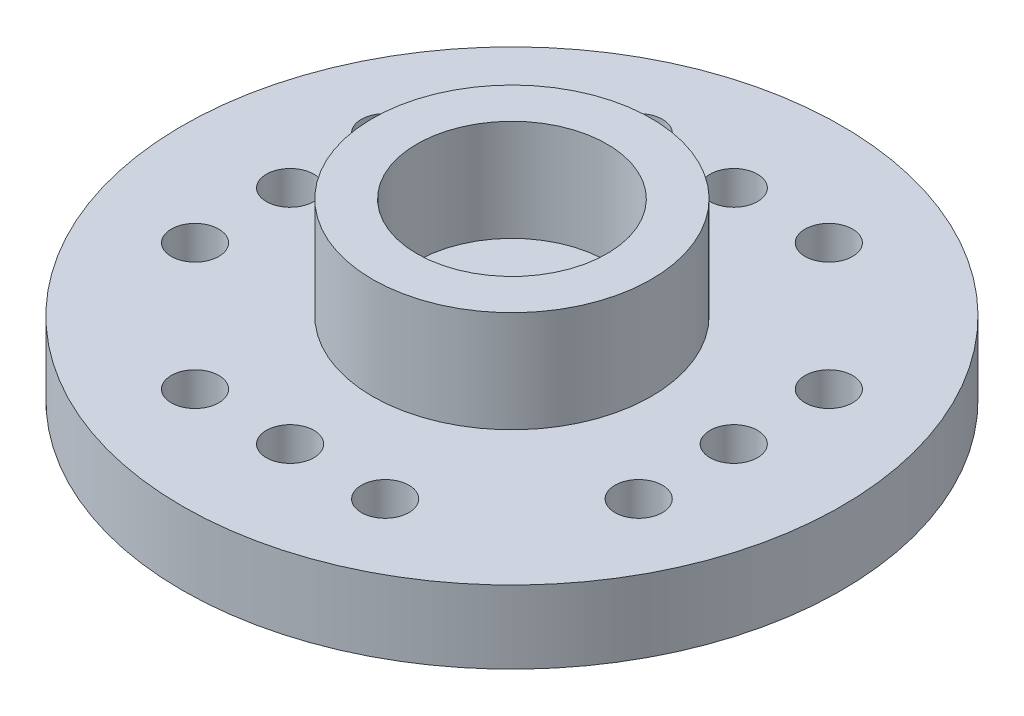
ISO-10303-21;
HEADER;
FILE_DESCRIPTION(('STEP AP214'),'2;1');
FILE_NAME('part.step','',(''),(''),'','','');
FILE_SCHEMA(('AUTOMOTIVE_DESIGN { 1 0 10303 214 1 1 1 1 }'));
ENDSEC;
DATA;
#1=APPLICATION_CONTEXT('core data for automotive mechanical design processes');
#2=APPLICATION_PROTOCOL_DEFINITION('international standard','automotive_design',2000,#1);
#3=PRODUCT_CONTEXT('',#1,'mechanical');
#4=PRODUCT('Part','Part','',(#3));
#5=PRODUCT_RELATED_PRODUCT_CATEGORY('part','',(#4));
#6=PRODUCT_DEFINITION_FORMATION('','',#4);
#7=PRODUCT_DEFINITION_CONTEXT('part definition',#1,'design');
#8=PRODUCT_DEFINITION('design','',#6,#7);
#9=PRODUCT_DEFINITION_SHAPE('','',#8);
#10=(LENGTH_UNIT() NAMED_UNIT(*) SI_UNIT(.MILLI.,.METRE.));
#11=(NAMED_UNIT(*) PLANE_ANGLE_UNIT() SI_UNIT($,.RADIAN.));
#12=(NAMED_UNIT(*) SI_UNIT($,.STERADIAN.) SOLID_ANGLE_UNIT());
#13=UNCERTAINTY_MEASURE_WITH_UNIT(LENGTH_MEASURE(1.E-05),#10,'distance_accuracy_value','');
#14=(GEOMETRIC_REPRESENTATION_CONTEXT(3) GLOBAL_UNCERTAINTY_ASSIGNED_CONTEXT((#13)) GLOBAL_UNIT_ASSIGNED_CONTEXT((#10,
#11,#12)) REPRESENTATION_CONTEXT('',''));
#15=CARTESIAN_POINT('',(0.,0.,0.));
#16=DIRECTION('',(0.,0.,1.));
#17=DIRECTION('',(1.,0.,0.));
#18=AXIS2_PLACEMENT_3D('',#15,#16,#17);
#19=CARTESIAN_POINT('',(0.,2.3,0.));
#20=DIRECTION('',(0.,1.,0.));
#21=DIRECTION('',(0.,0.,1.));
#22=AXIS2_PLACEMENT_3D('',#19,#20,#21);
#23=PLANE('',#22);
#24=CARTESIAN_POINT('',(0.,2.3,0.));
#25=DIRECTION('',(0.,1.,0.));
#26=DIRECTION('',(0.,0.,1.));
#27=AXIS2_PLACEMENT_3D('',#24,#25,#26);
#28=CIRCLE('',#27,1.5);
#29=CARTESIAN_POINT('',(0.,2.3,1.5));
#30=VERTEX_POINT('',#29);
#31=EDGE_CURVE('E121',#30,#30,#28,.T.);
#32=ORIENTED_EDGE('',*,*,#31,.F.);
#33=EDGE_LOOP('',(#32));
#34=FACE_BOUND('',#33,.T.);
#35=CARTESIAN_POINT('',(0.,2.3,0.));
#36=DIRECTION('',(0.,1.,0.));
#37=DIRECTION('',(0.,0.,1.));
#38=AXIS2_PLACEMENT_3D('',#35,#36,#37);
#39=CIRCLE('',#38,3.);
#40=CARTESIAN_POINT('',(0.,2.3,3.));
#41=VERTEX_POINT('',#40);
#42=EDGE_CURVE('E10',#41,#41,#39,.F.);
#43=ORIENTED_EDGE('',*,*,#42,.F.);
#44=EDGE_LOOP('',(#43));
#45=FACE_BOUND('',#44,.T.);
#46=ADVANCED_FACE('F34',(#34,#45),#23,.T.);
#47=CARTESIAN_POINT('',(0.,2.3,0.));
#48=DIRECTION('',(0.,1.,0.));
#49=DIRECTION('',(0.,0.,1.));
#50=AXIS2_PLACEMENT_3D('',#47,#48,#49);
#51=CIRCLE('',#50,4.4);
#52=CARTESIAN_POINT('',(0.,2.3,4.4));
#53=VERTEX_POINT('',#52);
#54=EDGE_CURVE('E130',#53,#53,#51,.T.);
#55=ORIENTED_EDGE('',*,*,#54,.F.);
#56=EDGE_LOOP('',(#55));
#57=FACE_BOUND('',#56,.T.);
#58=CARTESIAN_POINT('',(3.,2.3,-7.));
#59=DIRECTION('',(0.,1.,0.));
#60=DIRECTION('',(0.,0.,-1.));
#61=AXIS2_PLACEMENT_3D('',#58,#59,#60);
#62=CIRCLE('',#61,0.75);
#63=CARTESIAN_POINT('',(3.,2.3,-7.75));
#64=VERTEX_POINT('',#63);
#65=EDGE_CURVE('E115',#64,#64,#62,.T.);
#66=ORIENTED_EDGE('',*,*,#65,.F.);
#67=EDGE_LOOP('',(#66));
#68=FACE_BOUND('',#67,.T.);
#69=CARTESIAN_POINT('',(-3.,2.3,-7.));
#70=DIRECTION('',(0.,1.,0.));
#71=DIRECTION('',(0.,0.,-1.));
#72=AXIS2_PLACEMENT_3D('',#69,#70,#71);
#73=CIRCLE('',#72,0.750000000000002);
#74=CARTESIAN_POINT('',(-3.,2.3,-7.75));
#75=VERTEX_POINT('',#74);
#76=EDGE_CURVE('E103',#75,#75,#73,.T.);
#77=ORIENTED_EDGE('',*,*,#76,.F.);
#78=EDGE_LOOP('',(#77));
#79=FACE_BOUND('',#78,.T.);
#80=CARTESIAN_POINT('',(-7.,2.3,0.));
#81=DIRECTION('',(0.,1.,0.));
#82=DIRECTION('',(0.,0.,1.));
#83=AXIS2_PLACEMENT_3D('',#80,#81,#82);
#84=CIRCLE('',#83,0.749999999999999);
#85=CARTESIAN_POINT('',(-7.,2.3,0.750000000000004));
#86=VERTEX_POINT('',#85);
#87=EDGE_CURVE('E91',#86,#86,#84,.T.);
#88=ORIENTED_EDGE('',*,*,#87,.F.);
#89=EDGE_LOOP('',(#88));
#90=FACE_BOUND('',#89,.T.);
#91=CARTESIAN_POINT('',(-3.00000000000001,2.3,6.99999999999999));
#92=DIRECTION('',(0.,1.,0.));
#93=DIRECTION('',(0.,0.,-1.));
#94=AXIS2_PLACEMENT_3D('',#91,#92,#93);
#95=CIRCLE('',#94,0.75);
#96=CARTESIAN_POINT('',(-3.00000000000001,2.3,6.24999999999999));
#97=VERTEX_POINT('',#96);
#98=EDGE_CURVE('E79',#97,#97,#95,.T.);
#99=ORIENTED_EDGE('',*,*,#98,.F.);
#100=EDGE_LOOP('',(#99));
#101=FACE_BOUND('',#100,.T.);
#102=CARTESIAN_POINT('',(2.99999999999999,2.3,6.99999999999999));
#103=DIRECTION('',(0.,1.,0.));
#104=DIRECTION('',(0.,0.,-1.));
#105=AXIS2_PLACEMENT_3D('',#102,#103,#104);
#106=CIRCLE('',#105,0.749999999999998);
#107=CARTESIAN_POINT('',(2.99999999999999,2.3,6.24999999999999));
#108=VERTEX_POINT('',#107);
#109=EDGE_CURVE('E67',#108,#108,#106,.T.);
#110=ORIENTED_EDGE('',*,*,#109,.F.);
#111=EDGE_LOOP('',(#110));
#112=FACE_BOUND('',#111,.T.);
#113=CARTESIAN_POINT('',(7.,2.3,-3.));
#114=DIRECTION('',(0.,1.,0.));
#115=DIRECTION('',(0.,0.,1.));
#116=AXIS2_PLACEMENT_3D('',#113,#114,#115);
#117=CIRCLE('',#116,0.75);
#118=CARTESIAN_POINT('',(7.,2.3,-2.25));
#119=VERTEX_POINT('',#118);
#120=EDGE_CURVE('E55',#119,#119,#117,.T.);
#121=ORIENTED_EDGE('',*,*,#120,.F.);
#122=EDGE_LOOP('',(#121));
#123=FACE_BOUND('',#122,.T.);
#124=CARTESIAN_POINT('',(0.,2.3,0.));
#125=DIRECTION('',(0.,1.,0.));
#126=DIRECTION('',(0.,0.,1.));
#127=AXIS2_PLACEMENT_3D('',#124,#125,#126);
#128=CIRCLE('',#127,10.4);
#129=CARTESIAN_POINT('',(0.,2.3,10.4));
#130=VERTEX_POINT('',#129);
#131=EDGE_CURVE('E41',#130,#130,#128,.T.);
#132=ORIENTED_EDGE('',*,*,#131,.T.);
#133=EDGE_LOOP('',(#132));
#134=FACE_BOUND('',#133,.T.);
#135=CARTESIAN_POINT('',(7.,2.3,0.));
#136=DIRECTION('',(0.,1.,0.));
#137=DIRECTION('',(0.,0.,1.));
#138=AXIS2_PLACEMENT_3D('',#135,#136,#137);
#139=CIRCLE('',#138,0.75);
#140=CARTESIAN_POINT('',(7.,2.3,0.749999999999998));
#141=VERTEX_POINT('',#140);
#142=EDGE_CURVE('E50',#141,#141,#139,.T.);
#143=ORIENTED_EDGE('',*,*,#142,.F.);
#144=EDGE_LOOP('',(#143));
#145=FACE_BOUND('',#144,.T.);
#146=CARTESIAN_POINT('',(7.,2.3,3.));
#147=DIRECTION('',(0.,1.,0.));
#148=DIRECTION('',(0.,0.,1.));
#149=AXIS2_PLACEMENT_3D('',#146,#147,#148);
#150=CIRCLE('',#149,0.75);
#151=CARTESIAN_POINT('',(7.,2.3,3.75));
#152=VERTEX_POINT('',#151);
#153=EDGE_CURVE('E61',#152,#152,#150,.T.);
#154=ORIENTED_EDGE('',*,*,#153,.F.);
#155=EDGE_LOOP('',(#154));
#156=FACE_BOUND('',#155,.T.);
#157=CARTESIAN_POINT('',(0.,2.3,6.99999999999999));
#158=DIRECTION('',(0.,1.,0.));
#159=DIRECTION('',(0.,0.,-1.));
#160=AXIS2_PLACEMENT_3D('',#157,#158,#159);
#161=CIRCLE('',#160,0.75);
#162=CARTESIAN_POINT('',(0.,2.3,6.24999999999999));
#163=VERTEX_POINT('',#162);
#164=EDGE_CURVE('E73',#163,#163,#161,.T.);
#165=ORIENTED_EDGE('',*,*,#164,.F.);
#166=EDGE_LOOP('',(#165));
#167=FACE_BOUND('',#166,.T.);
#168=CARTESIAN_POINT('',(-7.,2.3,3.));
#169=DIRECTION('',(0.,1.,0.));
#170=DIRECTION('',(0.,0.,1.));
#171=AXIS2_PLACEMENT_3D('',#168,#169,#170);
#172=CIRCLE('',#171,0.749999999999999);
#173=CARTESIAN_POINT('',(-7.,2.3,3.75));
#174=VERTEX_POINT('',#173);
#175=EDGE_CURVE('E85',#174,#174,#172,.T.);
#176=ORIENTED_EDGE('',*,*,#175,.F.);
#177=EDGE_LOOP('',(#176));
#178=FACE_BOUND('',#177,.T.);
#179=CARTESIAN_POINT('',(-6.99999999999999,2.3,-2.99999999999999));
#180=DIRECTION('',(0.,1.,0.));
#181=DIRECTION('',(0.,0.,1.));
#182=AXIS2_PLACEMENT_3D('',#179,#180,#181);
#183=CIRCLE('',#182,0.749999999999998);
#184=CARTESIAN_POINT('',(-6.99999999999999,2.3,-2.25));
#185=VERTEX_POINT('',#184);
#186=EDGE_CURVE('E97',#185,#185,#183,.T.);
#187=ORIENTED_EDGE('',*,*,#186,.F.);
#188=EDGE_LOOP('',(#187));
#189=FACE_BOUND('',#188,.T.);
#190=CARTESIAN_POINT('',(0.,2.3,-7.));
#191=DIRECTION('',(0.,1.,0.));
#192=DIRECTION('',(0.,0.,-1.));
#193=AXIS2_PLACEMENT_3D('',#190,#191,#192);
#194=CIRCLE('',#193,0.749999999999998);
#195=CARTESIAN_POINT('',(0.,2.3,-7.75));
#196=VERTEX_POINT('',#195);
#197=EDGE_CURVE('E109',#196,#196,#194,.T.);
#198=ORIENTED_EDGE('',*,*,#197,.F.);
#199=EDGE_LOOP('',(#198));
#200=FACE_BOUND('',#199,.T.);
#201=ADVANCED_FACE('F158',(#57,#68,#79,#90,#101,#112,#123,#134,#145,#156,#167,#178,#189,#200),
#23,.T.);
#202=CARTESIAN_POINT('',(0.,0.,0.));
#203=DIRECTION('',(0.,1.,0.));
#204=DIRECTION('',(0.,0.,1.));
#205=AXIS2_PLACEMENT_3D('',#202,#203,#204);
#206=PLANE('',#205);
#207=CARTESIAN_POINT('',(0.,0.,0.));
#208=DIRECTION('',(0.,1.,0.));
#209=DIRECTION('',(0.,0.,1.));
#210=AXIS2_PLACEMENT_3D('',#207,#208,#209);
#211=CIRCLE('',#210,10.4);
#212=CARTESIAN_POINT('',(0.,0.,10.4));
#213=VERTEX_POINT('',#212);
#214=EDGE_CURVE('E45',#213,#213,#211,.T.);
#215=ORIENTED_EDGE('',*,*,#214,.F.);
#216=EDGE_LOOP('',(#215));
#217=FACE_BOUND('',#216,.T.);
#218=CARTESIAN_POINT('',(7.,0.,0.));
#219=DIRECTION('',(0.,1.,0.));
#220=DIRECTION('',(0.,0.,1.));
#221=AXIS2_PLACEMENT_3D('',#218,#219,#220);
#222=CIRCLE('',#221,0.75);
#223=CARTESIAN_POINT('',(7.,0.,0.749999999999998));
#224=VERTEX_POINT('',#223);
#225=EDGE_CURVE('E52',#224,#224,#222,.T.);
#226=ORIENTED_EDGE('',*,*,#225,.T.);
#227=EDGE_LOOP('',(#226));
#228=FACE_BOUND('',#227,.T.);
#229=CARTESIAN_POINT('',(7.,0.,-3.));
#230=DIRECTION('',(0.,1.,0.));
#231=DIRECTION('',(0.,0.,1.));
#232=AXIS2_PLACEMENT_3D('',#229,#230,#231);
#233=CIRCLE('',#232,0.75);
#234=CARTESIAN_POINT('',(7.,0.,-2.25));
#235=VERTEX_POINT('',#234);
#236=EDGE_CURVE('E58',#235,#235,#233,.T.);
#237=ORIENTED_EDGE('',*,*,#236,.T.);
#238=EDGE_LOOP('',(#237));
#239=FACE_BOUND('',#238,.T.);
#240=CARTESIAN_POINT('',(7.,0.,3.));
#241=DIRECTION('',(0.,1.,0.));
#242=DIRECTION('',(0.,0.,1.));
#243=AXIS2_PLACEMENT_3D('',#240,#241,#242);
#244=CIRCLE('',#243,0.75);
#245=CARTESIAN_POINT('',(7.,0.,3.75));
#246=VERTEX_POINT('',#245);
#247=EDGE_CURVE('E64',#246,#246,#244,.T.);
#248=ORIENTED_EDGE('',*,*,#247,.T.);
#249=EDGE_LOOP('',(#248));
#250=FACE_BOUND('',#249,.T.);
#251=CARTESIAN_POINT('',(2.99999999999999,0.,6.99999999999999));
#252=DIRECTION('',(0.,1.,0.));
#253=DIRECTION('',(0.,0.,-1.));
#254=AXIS2_PLACEMENT_3D('',#251,#252,#253);
#255=CIRCLE('',#254,0.749999999999998);
#256=CARTESIAN_POINT('',(2.99999999999999,0.,6.24999999999999));
#257=VERTEX_POINT('',#256);
#258=EDGE_CURVE('E70',#257,#257,#255,.T.);
#259=ORIENTED_EDGE('',*,*,#258,.T.);
#260=EDGE_LOOP('',(#259));
#261=FACE_BOUND('',#260,.T.);
#262=CARTESIAN_POINT('',(0.,0.,6.99999999999999));
#263=DIRECTION('',(0.,1.,0.));
#264=DIRECTION('',(0.,0.,-1.));
#265=AXIS2_PLACEMENT_3D('',#262,#263,#264);
#266=CIRCLE('',#265,0.75);
#267=CARTESIAN_POINT('',(0.,0.,6.24999999999999));
#268=VERTEX_POINT('',#267);
#269=EDGE_CURVE('E76',#268,#268,#266,.T.);
#270=ORIENTED_EDGE('',*,*,#269,.T.);
#271=EDGE_LOOP('',(#270));
#272=FACE_BOUND('',#271,.T.);
#273=CARTESIAN_POINT('',(-3.00000000000001,0.,6.99999999999999));
#274=DIRECTION('',(0.,1.,0.));
#275=DIRECTION('',(0.,0.,-1.));
#276=AXIS2_PLACEMENT_3D('',#273,#274,#275);
#277=CIRCLE('',#276,0.75);
#278=CARTESIAN_POINT('',(-3.00000000000001,0.,6.24999999999999));
#279=VERTEX_POINT('',#278);
#280=EDGE_CURVE('E82',#279,#279,#277,.T.);
#281=ORIENTED_EDGE('',*,*,#280,.T.);
#282=EDGE_LOOP('',(#281));
#283=FACE_BOUND('',#282,.T.);
#284=CARTESIAN_POINT('',(-7.,0.,3.));
#285=DIRECTION('',(0.,1.,0.));
#286=DIRECTION('',(0.,0.,1.));
#287=AXIS2_PLACEMENT_3D('',#284,#285,#286);
#288=CIRCLE('',#287,0.749999999999999);
#289=CARTESIAN_POINT('',(-7.,0.,3.75));
#290=VERTEX_POINT('',#289);
#291=EDGE_CURVE('E88',#290,#290,#288,.T.);
#292=ORIENTED_EDGE('',*,*,#291,.T.);
#293=EDGE_LOOP('',(#292));
#294=FACE_BOUND('',#293,.T.);
#295=CARTESIAN_POINT('',(-7.,0.,0.));
#296=DIRECTION('',(0.,1.,0.));
#297=DIRECTION('',(0.,0.,1.));
#298=AXIS2_PLACEMENT_3D('',#295,#296,#297);
#299=CIRCLE('',#298,0.749999999999999);
#300=CARTESIAN_POINT('',(-7.,0.,0.750000000000004));
#301=VERTEX_POINT('',#300);
#302=EDGE_CURVE('E94',#301,#301,#299,.T.);
#303=ORIENTED_EDGE('',*,*,#302,.T.);
#304=EDGE_LOOP('',(#303));
#305=FACE_BOUND('',#304,.T.);
#306=CARTESIAN_POINT('',(-6.99999999999999,0.,-2.99999999999999));
#307=DIRECTION('',(0.,1.,0.));
#308=DIRECTION('',(0.,0.,1.));
#309=AXIS2_PLACEMENT_3D('',#306,#307,#308);
#310=CIRCLE('',#309,0.749999999999998);
#311=CARTESIAN_POINT('',(-6.99999999999999,0.,-2.25));
#312=VERTEX_POINT('',#311);
#313=EDGE_CURVE('E100',#312,#312,#310,.T.);
#314=ORIENTED_EDGE('',*,*,#313,.T.);
#315=EDGE_LOOP('',(#314));
#316=FACE_BOUND('',#315,.T.);
#317=CARTESIAN_POINT('',(-3.,0.,-7.));
#318=DIRECTION('',(0.,1.,0.));
#319=DIRECTION('',(0.,0.,-1.));
#320=AXIS2_PLACEMENT_3D('',#317,#318,#319);
#321=CIRCLE('',#320,0.750000000000002);
#322=CARTESIAN_POINT('',(-3.,0.,-7.75));
#323=VERTEX_POINT('',#322);
#324=EDGE_CURVE('E106',#323,#323,#321,.T.);
#325=ORIENTED_EDGE('',*,*,#324,.T.);
#326=EDGE_LOOP('',(#325));
#327=FACE_BOUND('',#326,.T.);
#328=CARTESIAN_POINT('',(0.,0.,-7.));
#329=DIRECTION('',(0.,1.,0.));
#330=DIRECTION('',(0.,0.,-1.));
#331=AXIS2_PLACEMENT_3D('',#328,#329,#330);
#332=CIRCLE('',#331,0.749999999999998);
#333=CARTESIAN_POINT('',(0.,0.,-7.75));
#334=VERTEX_POINT('',#333);
#335=EDGE_CURVE('E112',#334,#334,#332,.T.);
#336=ORIENTED_EDGE('',*,*,#335,.T.);
#337=EDGE_LOOP('',(#336));
#338=FACE_BOUND('',#337,.T.);
#339=CARTESIAN_POINT('',(3.,0.,-7.));
#340=DIRECTION('',(0.,1.,0.));
#341=DIRECTION('',(0.,0.,-1.));
#342=AXIS2_PLACEMENT_3D('',#339,#340,#341);
#343=CIRCLE('',#342,0.75);
#344=CARTESIAN_POINT('',(3.,0.,-7.75));
#345=VERTEX_POINT('',#344);
#346=EDGE_CURVE('E118',#345,#345,#343,.T.);
#347=ORIENTED_EDGE('',*,*,#346,.T.);
#348=EDGE_LOOP('',(#347));
#349=FACE_BOUND('',#348,.T.);
#350=CARTESIAN_POINT('',(0.,0.,0.));
#351=DIRECTION('',(0.,1.,0.));
#352=DIRECTION('',(0.,0.,1.));
#353=AXIS2_PLACEMENT_3D('',#350,#351,#352);
#354=CIRCLE('',#353,1.5);
#355=CARTESIAN_POINT('',(0.,0.,1.5));
#356=VERTEX_POINT('',#355);
#357=EDGE_CURVE('E124',#356,#356,#354,.T.);
#358=ORIENTED_EDGE('',*,*,#357,.T.);
#359=EDGE_LOOP('',(#358));
#360=FACE_BOUND('',#359,.T.);
#361=ADVANCED_FACE('F164',(#217,#228,#239,#250,#261,#272,#283,#294,#305,#316,#327,#338,#349,
#360),#206,.F.);
#362=CARTESIAN_POINT('',(0.,2.3,0.));
#363=DIRECTION('',(0.,-1.,0.));
#364=DIRECTION('',(0.,0.,-1.));
#365=AXIS2_PLACEMENT_3D('',#362,#363,#364);
#366=CYLINDRICAL_SURFACE('',#365,10.4);
#367=ORIENTED_EDGE('',*,*,#131,.F.);
#368=EDGE_LOOP('',(#367));
#369=FACE_BOUND('',#368,.T.);
#370=ORIENTED_EDGE('',*,*,#214,.T.);
#371=EDGE_LOOP('',(#370));
#372=FACE_BOUND('',#371,.T.);
#373=ADVANCED_FACE('F36',(#369,#372),#366,.T.);
#374=CARTESIAN_POINT('',(7.,2.3,0.));
#375=DIRECTION('',(0.,-1.,0.));
#376=DIRECTION('',(0.,0.,-1.));
#377=AXIS2_PLACEMENT_3D('',#374,#375,#376);
#378=CYLINDRICAL_SURFACE('',#377,0.75);
#379=ORIENTED_EDGE('',*,*,#142,.T.);
#380=EDGE_LOOP('',(#379));
#381=FACE_BOUND('',#380,.T.);
#382=ORIENTED_EDGE('',*,*,#225,.F.);
#383=EDGE_LOOP('',(#382));
#384=FACE_BOUND('',#383,.T.);
#385=ADVANCED_FACE('F169',(#381,#384),#378,.F.);
#386=CARTESIAN_POINT('',(7.,2.3,-3.));
#387=DIRECTION('',(0.,-1.,0.));
#388=DIRECTION('',(0.,0.,-1.));
#389=AXIS2_PLACEMENT_3D('',#386,#387,#388);
#390=CYLINDRICAL_SURFACE('',#389,0.75);
#391=ORIENTED_EDGE('',*,*,#120,.T.);
#392=EDGE_LOOP('',(#391));
#393=FACE_BOUND('',#392,.T.);
#394=ORIENTED_EDGE('',*,*,#236,.F.);
#395=EDGE_LOOP('',(#394));
#396=FACE_BOUND('',#395,.T.);
#397=ADVANCED_FACE('F246',(#393,#396),#390,.F.);
#398=CARTESIAN_POINT('',(7.,2.3,3.));
#399=DIRECTION('',(0.,-1.,0.));
#400=DIRECTION('',(0.,0.,-1.));
#401=AXIS2_PLACEMENT_3D('',#398,#399,#400);
#402=CYLINDRICAL_SURFACE('',#401,0.75);
#403=ORIENTED_EDGE('',*,*,#153,.T.);
#404=EDGE_LOOP('',(#403));
#405=FACE_BOUND('',#404,.T.);
#406=ORIENTED_EDGE('',*,*,#247,.F.);
#407=EDGE_LOOP('',(#406));
#408=FACE_BOUND('',#407,.T.);
#409=ADVANCED_FACE('F243',(#405,#408),#402,.F.);
#410=CARTESIAN_POINT('',(2.99999999999999,2.3,6.99999999999999));
#411=DIRECTION('',(0.,-1.,0.));
#412=DIRECTION('',(0.,0.,-1.));
#413=AXIS2_PLACEMENT_3D('',#410,#411,#412);
#414=CYLINDRICAL_SURFACE('',#413,0.749999999999998);
#415=ORIENTED_EDGE('',*,*,#109,.T.);
#416=EDGE_LOOP('',(#415));
#417=FACE_BOUND('',#416,.T.);
#418=ORIENTED_EDGE('',*,*,#258,.F.);
#419=EDGE_LOOP('',(#418));
#420=FACE_BOUND('',#419,.T.);
#421=ADVANCED_FACE('F239',(#417,#420),#414,.F.);
#422=CARTESIAN_POINT('',(0.,2.3,6.99999999999999));
#423=DIRECTION('',(0.,-1.,0.));
#424=DIRECTION('',(0.,0.,-1.));
#425=AXIS2_PLACEMENT_3D('',#422,#423,#424);
#426=CYLINDRICAL_SURFACE('',#425,0.75);
#427=ORIENTED_EDGE('',*,*,#164,.T.);
#428=EDGE_LOOP('',(#427));
#429=FACE_BOUND('',#428,.T.);
#430=ORIENTED_EDGE('',*,*,#269,.F.);
#431=EDGE_LOOP('',(#430));
#432=FACE_BOUND('',#431,.T.);
#433=ADVANCED_FACE('F235',(#429,#432),#426,.F.);
#434=CARTESIAN_POINT('',(-3.00000000000001,2.3,6.99999999999999));
#435=DIRECTION('',(0.,-1.,0.));
#436=DIRECTION('',(0.,0.,-1.));
#437=AXIS2_PLACEMENT_3D('',#434,#435,#436);
#438=CYLINDRICAL_SURFACE('',#437,0.75);
#439=ORIENTED_EDGE('',*,*,#98,.T.);
#440=EDGE_LOOP('',(#439));
#441=FACE_BOUND('',#440,.T.);
#442=ORIENTED_EDGE('',*,*,#280,.F.);
#443=EDGE_LOOP('',(#442));
#444=FACE_BOUND('',#443,.T.);
#445=ADVANCED_FACE('F231',(#441,#444),#438,.F.);
#446=CARTESIAN_POINT('',(-7.,2.3,3.));
#447=DIRECTION('',(0.,-1.,0.));
#448=DIRECTION('',(0.,0.,-1.));
#449=AXIS2_PLACEMENT_3D('',#446,#447,#448);
#450=CYLINDRICAL_SURFACE('',#449,0.749999999999999);
#451=ORIENTED_EDGE('',*,*,#175,.T.);
#452=EDGE_LOOP('',(#451));
#453=FACE_BOUND('',#452,.T.);
#454=ORIENTED_EDGE('',*,*,#291,.F.);
#455=EDGE_LOOP('',(#454));
#456=FACE_BOUND('',#455,.T.);
#457=ADVANCED_FACE('F227',(#453,#456),#450,.F.);
#458=CARTESIAN_POINT('',(-7.,2.3,0.));
#459=DIRECTION('',(0.,-1.,0.));
#460=DIRECTION('',(0.,0.,-1.));
#461=AXIS2_PLACEMENT_3D('',#458,#459,#460);
#462=CYLINDRICAL_SURFACE('',#461,0.749999999999999);
#463=ORIENTED_EDGE('',*,*,#87,.T.);
#464=EDGE_LOOP('',(#463));
#465=FACE_BOUND('',#464,.T.);
#466=ORIENTED_EDGE('',*,*,#302,.F.);
#467=EDGE_LOOP('',(#466));
#468=FACE_BOUND('',#467,.T.);
#469=ADVANCED_FACE('F223',(#465,#468),#462,.F.);
#470=CARTESIAN_POINT('',(-6.99999999999999,2.3,-2.99999999999999));
#471=DIRECTION('',(0.,-1.,0.));
#472=DIRECTION('',(0.,0.,-1.));
#473=AXIS2_PLACEMENT_3D('',#470,#471,#472);
#474=CYLINDRICAL_SURFACE('',#473,0.749999999999998);
#475=ORIENTED_EDGE('',*,*,#186,.T.);
#476=EDGE_LOOP('',(#475));
#477=FACE_BOUND('',#476,.T.);
#478=ORIENTED_EDGE('',*,*,#313,.F.);
#479=EDGE_LOOP('',(#478));
#480=FACE_BOUND('',#479,.T.);
#481=ADVANCED_FACE('F219',(#477,#480),#474,.F.);
#482=CARTESIAN_POINT('',(-3.,2.3,-7.));
#483=DIRECTION('',(0.,-1.,0.));
#484=DIRECTION('',(0.,0.,-1.));
#485=AXIS2_PLACEMENT_3D('',#482,#483,#484);
#486=CYLINDRICAL_SURFACE('',#485,0.750000000000002);
#487=ORIENTED_EDGE('',*,*,#76,.T.);
#488=EDGE_LOOP('',(#487));
#489=FACE_BOUND('',#488,.T.);
#490=ORIENTED_EDGE('',*,*,#324,.F.);
#491=EDGE_LOOP('',(#490));
#492=FACE_BOUND('',#491,.T.);
#493=ADVANCED_FACE('F213',(#489,#492),#486,.F.);
#494=CARTESIAN_POINT('',(0.,2.3,-7.));
#495=DIRECTION('',(0.,-1.,0.));
#496=DIRECTION('',(0.,0.,-1.));
#497=AXIS2_PLACEMENT_3D('',#494,#495,#496);
#498=CYLINDRICAL_SURFACE('',#497,0.749999999999998);
#499=ORIENTED_EDGE('',*,*,#197,.T.);
#500=EDGE_LOOP('',(#499));
#501=FACE_BOUND('',#500,.T.);
#502=ORIENTED_EDGE('',*,*,#335,.F.);
#503=EDGE_LOOP('',(#502));
#504=FACE_BOUND('',#503,.T.);
#505=ADVANCED_FACE('F207',(#501,#504),#498,.F.);
#506=CARTESIAN_POINT('',(3.,2.3,-7.));
#507=DIRECTION('',(0.,-1.,0.));
#508=DIRECTION('',(0.,0.,-1.));
#509=AXIS2_PLACEMENT_3D('',#506,#507,#508);
#510=CYLINDRICAL_SURFACE('',#509,0.75);
#511=ORIENTED_EDGE('',*,*,#65,.T.);
#512=EDGE_LOOP('',(#511));
#513=FACE_BOUND('',#512,.T.);
#514=ORIENTED_EDGE('',*,*,#346,.F.);
#515=EDGE_LOOP('',(#514));
#516=FACE_BOUND('',#515,.T.);
#517=ADVANCED_FACE('F153',(#513,#516),#510,.F.);
#518=CARTESIAN_POINT('',(0.,2.3,0.));
#519=DIRECTION('',(0.,-1.,0.));
#520=DIRECTION('',(0.,0.,-1.));
#521=AXIS2_PLACEMENT_3D('',#518,#519,#520);
#522=CYLINDRICAL_SURFACE('',#521,1.5);
#523=ORIENTED_EDGE('',*,*,#31,.T.);
#524=EDGE_LOOP('',(#523));
#525=FACE_BOUND('',#524,.T.);
#526=ORIENTED_EDGE('',*,*,#357,.F.);
#527=EDGE_LOOP('',(#526));
#528=FACE_BOUND('',#527,.T.);
#529=ADVANCED_FACE('F144',(#525,#528),#522,.F.);
#530=CARTESIAN_POINT('',(0.,5.5,0.));
#531=DIRECTION('',(0.,1.,0.));
#532=DIRECTION('',(0.,0.,1.));
#533=AXIS2_PLACEMENT_3D('',#530,#531,#532);
#534=PLANE('',#533);
#535=CARTESIAN_POINT('',(0.,5.5,0.));
#536=DIRECTION('',(0.,1.,0.));
#537=DIRECTION('',(0.,0.,1.));
#538=AXIS2_PLACEMENT_3D('',#535,#536,#537);
#539=CIRCLE('',#538,4.4);
#540=CARTESIAN_POINT('',(0.,5.5,4.4));
#541=VERTEX_POINT('',#540);
#542=EDGE_CURVE('E127',#541,#541,#539,.T.);
#543=ORIENTED_EDGE('',*,*,#542,.T.);
#544=EDGE_LOOP('',(#543));
#545=FACE_BOUND('',#544,.T.);
#546=CARTESIAN_POINT('',(0.,5.5,0.));
#547=DIRECTION('',(0.,1.,0.));
#548=DIRECTION('',(0.,0.,1.));
#549=AXIS2_PLACEMENT_3D('',#546,#547,#548);
#550=CIRCLE('',#549,3.);
#551=CARTESIAN_POINT('',(0.,5.5,3.));
#552=VERTEX_POINT('',#551);
#553=EDGE_CURVE('E133',#552,#552,#550,.T.);
#554=ORIENTED_EDGE('',*,*,#553,.F.);
#555=EDGE_LOOP('',(#554));
#556=FACE_BOUND('',#555,.T.);
#557=ADVANCED_FACE('F141',(#545,#556),#534,.T.);
#558=CARTESIAN_POINT('',(0.,5.5,0.));
#559=DIRECTION('',(0.,-1.,0.));
#560=DIRECTION('',(0.,0.,-1.));
#561=AXIS2_PLACEMENT_3D('',#558,#559,#560);
#562=CYLINDRICAL_SURFACE('',#561,4.4);
#563=ORIENTED_EDGE('',*,*,#542,.F.);
#564=EDGE_LOOP('',(#563));
#565=FACE_BOUND('',#564,.T.);
#566=ORIENTED_EDGE('',*,*,#54,.T.);
#567=EDGE_LOOP('',(#566));
#568=FACE_BOUND('',#567,.T.);
#569=ADVANCED_FACE('F143',(#565,#568),#562,.T.);
#570=CARTESIAN_POINT('',(0.,5.5,0.));
#571=DIRECTION('',(0.,-1.,0.));
#572=DIRECTION('',(0.,0.,-1.));
#573=AXIS2_PLACEMENT_3D('',#570,#571,#572);
#574=CYLINDRICAL_SURFACE('',#573,3.);
#575=ORIENTED_EDGE('',*,*,#553,.T.);
#576=EDGE_LOOP('',(#575));
#577=FACE_BOUND('',#576,.T.);
#578=ORIENTED_EDGE('',*,*,#42,.T.);
#579=EDGE_LOOP('',(#578));
#580=FACE_BOUND('',#579,.T.);
#581=ADVANCED_FACE('F139',(#577,#580),#574,.F.);
#582=CLOSED_SHELL('',(#46,#201,#361,#373,#385,#397,#409,#421,#433,#445,#457,#469,#481,#493,#505,
#517,#529,#557,#569,#581));
#583=MANIFOLD_SOLID_BREP('B2',#582);
#584=ADVANCED_BREP_SHAPE_REPRESENTATION('',(#18,#583),#14);
#585=SHAPE_DEFINITION_REPRESENTATION(#9,#584);
ENDSEC;
END-ISO-10303-21;
